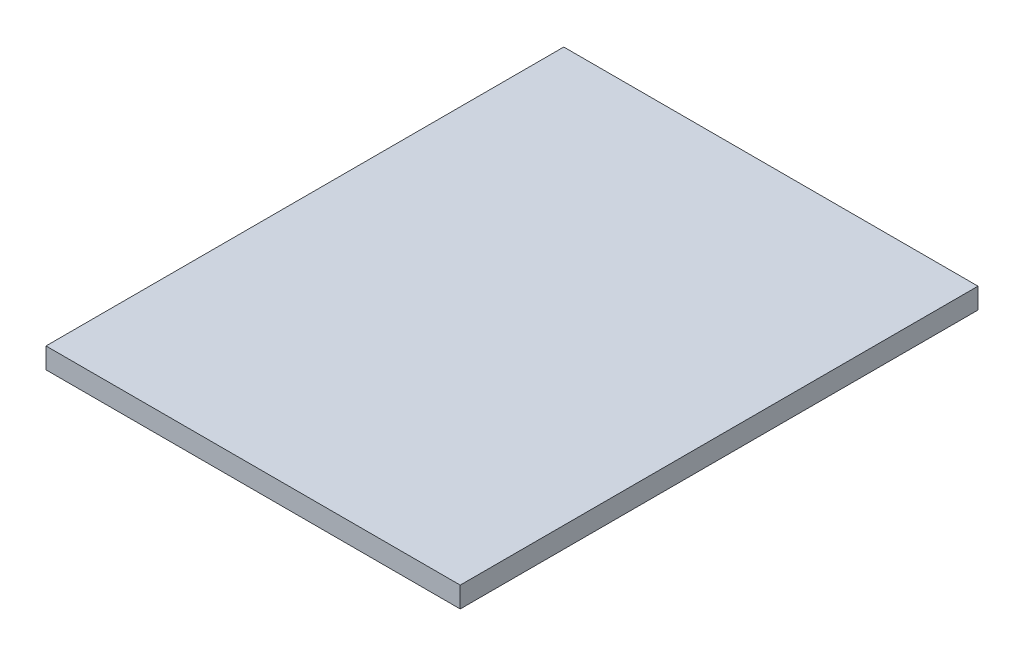
ISO-10303-21;
HEADER;
FILE_DESCRIPTION(('STEP AP214'),'2;1');
FILE_NAME('part.step','',(''),(''),'','','');
FILE_SCHEMA(('AUTOMOTIVE_DESIGN { 1 0 10303 214 1 1 1 1 }'));
ENDSEC;
DATA;
#1=APPLICATION_CONTEXT('core data for automotive mechanical design processes');
#2=APPLICATION_PROTOCOL_DEFINITION('international standard','automotive_design',2000,#1);
#3=PRODUCT_CONTEXT('',#1,'mechanical');
#4=PRODUCT('Part','Part','',(#3));
#5=PRODUCT_RELATED_PRODUCT_CATEGORY('part','',(#4));
#6=PRODUCT_DEFINITION_FORMATION('','',#4);
#7=PRODUCT_DEFINITION_CONTEXT('part definition',#1,'design');
#8=PRODUCT_DEFINITION('design','',#6,#7);
#9=PRODUCT_DEFINITION_SHAPE('','',#8);
#10=(LENGTH_UNIT() NAMED_UNIT(*) SI_UNIT(.MILLI.,.METRE.));
#11=(NAMED_UNIT(*) PLANE_ANGLE_UNIT() SI_UNIT($,.RADIAN.));
#12=(NAMED_UNIT(*) SI_UNIT($,.STERADIAN.) SOLID_ANGLE_UNIT());
#13=UNCERTAINTY_MEASURE_WITH_UNIT(LENGTH_MEASURE(1.E-05),#10,'distance_accuracy_value','');
#14=(GEOMETRIC_REPRESENTATION_CONTEXT(3) GLOBAL_UNCERTAINTY_ASSIGNED_CONTEXT((#13)) GLOBAL_UNIT_ASSIGNED_CONTEXT((#10,
#11,#12)) REPRESENTATION_CONTEXT('',''));
#15=CARTESIAN_POINT('',(0.,0.,0.));
#16=DIRECTION('',(0.,0.,1.));
#17=DIRECTION('',(1.,0.,0.));
#18=AXIS2_PLACEMENT_3D('',#15,#16,#17);
#19=CARTESIAN_POINT('',(0.6484614127169,0.31,-0.580957148708004));
#20=DIRECTION('',(-1.,0.,0.));
#21=DIRECTION('',(0.,0.,1.));
#22=AXIS2_PLACEMENT_3D('',#19,#20,#21);
#23=PLANE('',#22);
#24=DIRECTION('',(0.,0.,-1.));
#25=VECTOR('',#24,1.);
#26=CARTESIAN_POINT('',(0.6484614127169,0.3,-0.580957148708004));
#27=LINE('',#26,#25);
#28=CARTESIAN_POINT('',(0.6484614127169,0.3,-0.330957148708003));
#29=VERTEX_POINT('',#28);
#30=CARTESIAN_POINT('',(0.6484614127169,0.3,-0.580957148708004));
#31=VERTEX_POINT('',#30);
#32=EDGE_CURVE('E11',#29,#31,#27,.T.);
#33=ORIENTED_EDGE('',*,*,#32,.T.);
#34=DIRECTION('',(0.,-1.,0.));
#35=VECTOR('',#34,1.);
#36=CARTESIAN_POINT('',(0.6484614127169,0.31,-0.580957148708004));
#37=LINE('',#36,#35);
#38=CARTESIAN_POINT('',(0.6484614127169,0.31,-0.580957148708004));
#39=VERTEX_POINT('',#38);
#40=EDGE_CURVE('E24',#39,#31,#37,.T.);
#41=ORIENTED_EDGE('',*,*,#40,.F.);
#42=DIRECTION('',(0.,0.,-1.));
#43=VECTOR('',#42,1.);
#44=CARTESIAN_POINT('',(0.6484614127169,0.31,-0.580957148708004));
#45=LINE('',#44,#43);
#46=CARTESIAN_POINT('',(0.6484614127169,0.31,-0.330957148708003));
#47=VERTEX_POINT('',#46);
#48=EDGE_CURVE('E88',#47,#39,#45,.T.);
#49=ORIENTED_EDGE('',*,*,#48,.F.);
#50=DIRECTION('',(0.,-1.,0.));
#51=VECTOR('',#50,1.);
#52=CARTESIAN_POINT('',(0.6484614127169,0.31,-0.330957148708003));
#53=LINE('',#52,#51);
#54=EDGE_CURVE('E77',#47,#29,#53,.T.);
#55=ORIENTED_EDGE('',*,*,#54,.T.);
#56=EDGE_LOOP('',(#33,#41,#49,#55));
#57=FACE_BOUND('',#56,.T.);
#58=ADVANCED_FACE('F17',(#57),#23,.F.);
#59=CARTESIAN_POINT('',(0.6484614127169,0.31,-0.580957148708004));
#60=DIRECTION('',(0.,0.,1.));
#61=DIRECTION('',(1.,0.,0.));
#62=AXIS2_PLACEMENT_3D('',#59,#60,#61);
#63=PLANE('',#62);
#64=DIRECTION('',(-1.,0.,0.));
#65=VECTOR('',#64,1.);
#66=CARTESIAN_POINT('',(0.6484614127169,0.3,-0.580957148708004));
#67=LINE('',#66,#65);
#68=CARTESIAN_POINT('',(0.4484614127169,0.3,-0.580957148708003));
#69=VERTEX_POINT('',#68);
#70=EDGE_CURVE('E85',#31,#69,#67,.T.);
#71=ORIENTED_EDGE('',*,*,#70,.T.);
#72=DIRECTION('',(0.,-1.,0.));
#73=VECTOR('',#72,1.);
#74=CARTESIAN_POINT('',(0.4484614127169,0.31,-0.580957148708003));
#75=LINE('',#74,#73);
#76=CARTESIAN_POINT('',(0.4484614127169,0.31,-0.580957148708003));
#77=VERTEX_POINT('',#76);
#78=EDGE_CURVE('E83',#77,#69,#75,.T.);
#79=ORIENTED_EDGE('',*,*,#78,.F.);
#80=DIRECTION('',(-1.,0.,0.));
#81=VECTOR('',#80,1.);
#82=CARTESIAN_POINT('',(0.6484614127169,0.31,-0.580957148708004));
#83=LINE('',#82,#81);
#84=EDGE_CURVE('E72',#39,#77,#83,.T.);
#85=ORIENTED_EDGE('',*,*,#84,.F.);
#86=ORIENTED_EDGE('',*,*,#40,.T.);
#87=EDGE_LOOP('',(#71,#79,#85,#86));
#88=FACE_BOUND('',#87,.T.);
#89=ADVANCED_FACE('F90',(#88),#63,.F.);
#90=CARTESIAN_POINT('',(0.4484614127169,0.31,-0.580957148708003));
#91=DIRECTION('',(1.,0.,0.));
#92=DIRECTION('',(0.,0.,-1.));
#93=AXIS2_PLACEMENT_3D('',#90,#91,#92);
#94=PLANE('',#93);
#95=DIRECTION('',(0.,0.,1.));
#96=VECTOR('',#95,1.);
#97=CARTESIAN_POINT('',(0.4484614127169,0.3,-0.580957148708003));
#98=LINE('',#97,#96);
#99=CARTESIAN_POINT('',(0.4484614127169,0.3,-0.330957148708003));
#100=VERTEX_POINT('',#99);
#101=EDGE_CURVE('E60',#69,#100,#98,.T.);
#102=ORIENTED_EDGE('',*,*,#101,.T.);
#103=DIRECTION('',(0.,-1.,0.));
#104=VECTOR('',#103,1.);
#105=CARTESIAN_POINT('',(0.4484614127169,0.31,-0.330957148708003));
#106=LINE('',#105,#104);
#107=CARTESIAN_POINT('',(0.4484614127169,0.31,-0.330957148708003));
#108=VERTEX_POINT('',#107);
#109=EDGE_CURVE('E54',#108,#100,#106,.T.);
#110=ORIENTED_EDGE('',*,*,#109,.F.);
#111=DIRECTION('',(0.,0.,1.));
#112=VECTOR('',#111,1.);
#113=CARTESIAN_POINT('',(0.4484614127169,0.31,-0.580957148708003));
#114=LINE('',#113,#112);
#115=EDGE_CURVE('E58',#77,#108,#114,.T.);
#116=ORIENTED_EDGE('',*,*,#115,.F.);
#117=ORIENTED_EDGE('',*,*,#78,.T.);
#118=EDGE_LOOP('',(#102,#110,#116,#117));
#119=FACE_BOUND('',#118,.T.);
#120=ADVANCED_FACE('F56',(#119),#94,.F.);
#121=CARTESIAN_POINT('',(0.6484614127169,0.31,-0.330957148708003));
#122=DIRECTION('',(0.,0.,-1.));
#123=DIRECTION('',(-1.,0.,0.));
#124=AXIS2_PLACEMENT_3D('',#121,#122,#123);
#125=PLANE('',#124);
#126=DIRECTION('',(1.,0.,0.));
#127=VECTOR('',#126,1.);
#128=CARTESIAN_POINT('',(0.6484614127169,0.3,-0.330957148708003));
#129=LINE('',#128,#127);
#130=EDGE_CURVE('E73',#100,#29,#129,.T.);
#131=ORIENTED_EDGE('',*,*,#130,.T.);
#132=ORIENTED_EDGE('',*,*,#54,.F.);
#133=DIRECTION('',(1.,0.,0.));
#134=VECTOR('',#133,1.);
#135=CARTESIAN_POINT('',(0.6484614127169,0.31,-0.330957148708003));
#136=LINE('',#135,#134);
#137=EDGE_CURVE('E70',#108,#47,#136,.T.);
#138=ORIENTED_EDGE('',*,*,#137,.F.);
#139=ORIENTED_EDGE('',*,*,#109,.T.);
#140=EDGE_LOOP('',(#131,#132,#138,#139));
#141=FACE_BOUND('',#140,.T.);
#142=ADVANCED_FACE('F76',(#141),#125,.F.);
#143=CARTESIAN_POINT('',(0.,0.31,0.));
#144=DIRECTION('',(0.,-1.,0.));
#145=DIRECTION('',(0.,0.,-1.));
#146=AXIS2_PLACEMENT_3D('',#143,#144,#145);
#147=PLANE('',#146);
#148=ORIENTED_EDGE('',*,*,#48,.T.);
#149=ORIENTED_EDGE('',*,*,#84,.T.);
#150=ORIENTED_EDGE('',*,*,#115,.T.);
#151=ORIENTED_EDGE('',*,*,#137,.T.);
#152=EDGE_LOOP('',(#148,#149,#150,#151));
#153=FACE_BOUND('',#152,.T.);
#154=ADVANCED_FACE('F69',(#153),#147,.F.);
#155=CARTESIAN_POINT('',(0.,0.3,0.));
#156=DIRECTION('',(0.,-1.,0.));
#157=DIRECTION('',(0.,0.,-1.));
#158=AXIS2_PLACEMENT_3D('',#155,#156,#157);
#159=PLANE('',#158);
#160=ORIENTED_EDGE('',*,*,#32,.F.);
#161=ORIENTED_EDGE('',*,*,#130,.F.);
#162=ORIENTED_EDGE('',*,*,#101,.F.);
#163=ORIENTED_EDGE('',*,*,#70,.F.);
#164=EDGE_LOOP('',(#160,#161,#162,#163));
#165=FACE_BOUND('',#164,.T.);
#166=ADVANCED_FACE('F91',(#165),#159,.T.);
#167=CLOSED_SHELL('',(#58,#89,#120,#142,#154,#166));
#168=MANIFOLD_SOLID_BREP('B1',#167);
#169=ADVANCED_BREP_SHAPE_REPRESENTATION('',(#18,#168),#14);
#170=SHAPE_DEFINITION_REPRESENTATION(#9,#169);
ENDSEC;
END-ISO-10303-21;
